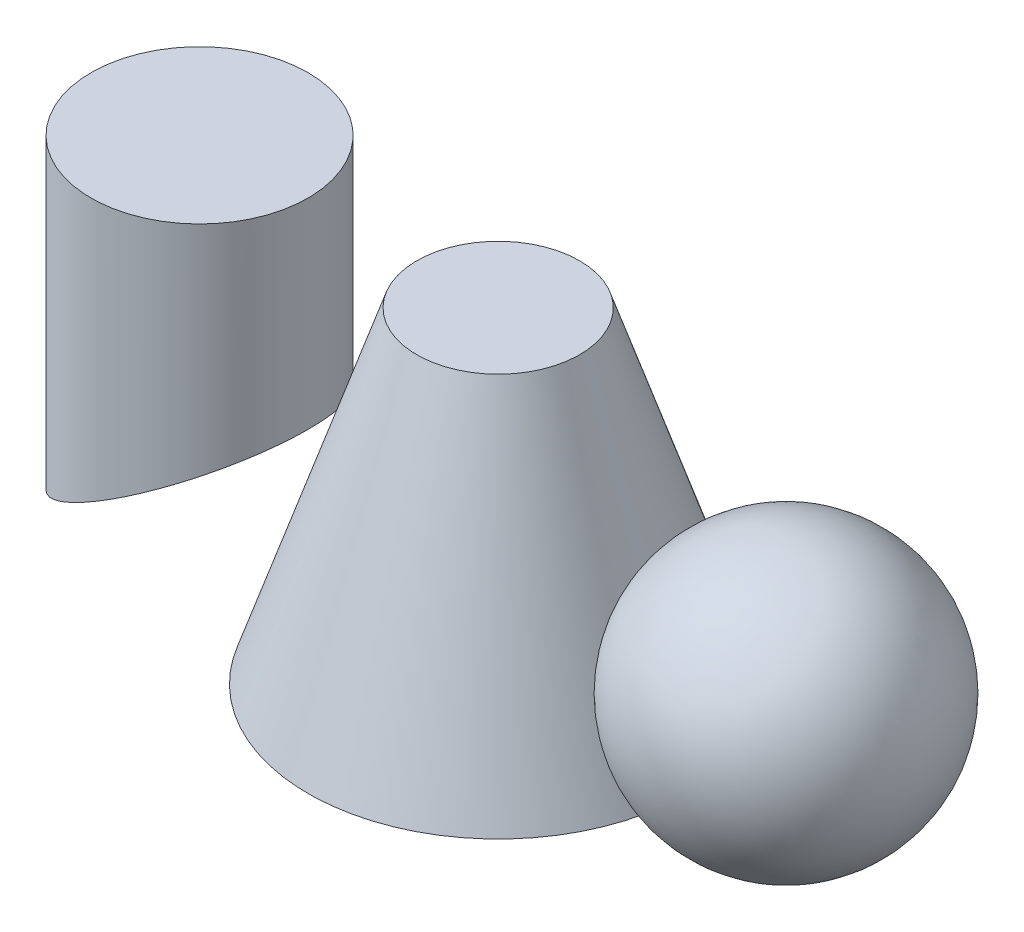
ISO-10303-21;
HEADER;
FILE_DESCRIPTION(('STEP AP214'),'2;1');
FILE_NAME('part.step','',(''),(''),'','','');
FILE_SCHEMA(('AUTOMOTIVE_DESIGN { 1 0 10303 214 1 1 1 1 }'));
ENDSEC;
DATA;
#1=APPLICATION_CONTEXT('core data for automotive mechanical design processes');
#2=APPLICATION_PROTOCOL_DEFINITION('international standard','automotive_design',2000,#1);
#3=PRODUCT_CONTEXT('',#1,'mechanical');
#4=PRODUCT('Part','Part','',(#3));
#5=PRODUCT_RELATED_PRODUCT_CATEGORY('part','',(#4));
#6=PRODUCT_DEFINITION_FORMATION('','',#4);
#7=PRODUCT_DEFINITION_CONTEXT('part definition',#1,'design');
#8=PRODUCT_DEFINITION('design','',#6,#7);
#9=PRODUCT_DEFINITION_SHAPE('','',#8);
#10=(LENGTH_UNIT() NAMED_UNIT(*) SI_UNIT(.MILLI.,.METRE.));
#11=(NAMED_UNIT(*) PLANE_ANGLE_UNIT() SI_UNIT($,.RADIAN.));
#12=(NAMED_UNIT(*) SI_UNIT($,.STERADIAN.) SOLID_ANGLE_UNIT());
#13=UNCERTAINTY_MEASURE_WITH_UNIT(LENGTH_MEASURE(1.E-05),#10,'distance_accuracy_value','');
#14=(GEOMETRIC_REPRESENTATION_CONTEXT(3) GLOBAL_UNCERTAINTY_ASSIGNED_CONTEXT((#13)) GLOBAL_UNIT_ASSIGNED_CONTEXT((#10,
#11,#12)) REPRESENTATION_CONTEXT('',''));
#15=CARTESIAN_POINT('',(0.,0.,0.));
#16=DIRECTION('',(0.,0.,1.));
#17=DIRECTION('',(1.,0.,0.));
#18=AXIS2_PLACEMENT_3D('',#15,#16,#17);
#19=CARTESIAN_POINT('',(53.0189805014032,25.,0.));
#20=DIRECTION('',(0.,1.,0.));
#21=DIRECTION('',(1.,0.,0.));
#22=AXIS2_PLACEMENT_3D('',#19,#20,#21);
#23=SPHERICAL_SURFACE('',#22,25.);
#24=CARTESIAN_POINT('',(53.0189805014032,50.,0.));
#25=VERTEX_POINT('',#24);
#26=VERTEX_LOOP('',#25);
#27=FACE_BOUND('',#26,.T.);
#28=ADVANCED_FACE('F36',(#27),#23,.T.);
#29=CLOSED_SHELL('',(#28));
#30=MANIFOLD_SOLID_BREP('B2',#29);
#31=CARTESIAN_POINT('',(-75.,0.,-30.));
#32=DIRECTION('',(-0.499999999999995,0.866025403784441,0.));
#33=DIRECTION('',(-0.866025403784442,-0.499999999999995,0.));
#34=AXIS2_PLACEMENT_3D('',#31,#32,#33);
#35=PLANE('',#34);
#36=CARTESIAN_POINT('',(-55.,11.5470053837924,0.));
#37=DIRECTION('',(-0.499999999999995,0.866025403784441,0.));
#38=DIRECTION('',(-0.866025403784442,-0.499999999999995,0.));
#39=AXIS2_PLACEMENT_3D('',#36,#37,#38);
#40=ELLIPSE('',#39,23.094010767585,20.);
#41=CARTESIAN_POINT('',(-75.,0.,0.));
#42=VERTEX_POINT('',#41);
#43=EDGE_CURVE('E65',#42,#42,#40,.F.);
#44=ORIENTED_EDGE('',*,*,#43,.T.);
#45=EDGE_LOOP('',(#44));
#46=FACE_BOUND('',#45,.T.);
#47=CARTESIAN_POINT('',(-55.,11.5470053837924,0.));
#48=DIRECTION('',(-0.499999999999995,0.866025403784441,0.));
#49=DIRECTION('',(-0.866025403784442,-0.499999999999995,0.));
#50=AXIS2_PLACEMENT_3D('',#47,#48,#49);
#51=ELLIPSE('',#50,21.9393102292057,19.);
#52=CARTESIAN_POINT('',(-74.,0.577350269189618,0.));
#53=VERTEX_POINT('',#52);
#54=EDGE_CURVE('E73',#53,#53,#51,.F.);
#55=ORIENTED_EDGE('',*,*,#54,.F.);
#56=EDGE_LOOP('',(#55));
#57=FACE_BOUND('',#56,.T.);
#58=ADVANCED_FACE('F58',(#46,#57),#35,.F.);
#59=CARTESIAN_POINT('',(-55.,0.,0.));
#60=DIRECTION('',(0.,-1.,0.));
#61=DIRECTION('',(0.,0.,-1.));
#62=AXIS2_PLACEMENT_3D('',#59,#60,#61);
#63=CYLINDRICAL_SURFACE('',#62,20.);
#64=ORIENTED_EDGE('',*,*,#43,.F.);
#65=EDGE_LOOP('',(#64));
#66=FACE_BOUND('',#65,.T.);
#67=CARTESIAN_POINT('',(-55.,60.,0.));
#68=DIRECTION('',(0.,-1.,0.));
#69=DIRECTION('',(0.,0.,-1.));
#70=AXIS2_PLACEMENT_3D('',#67,#68,#69);
#71=CIRCLE('',#70,20.);
#72=CARTESIAN_POINT('',(-55.,60.,-20.));
#73=VERTEX_POINT('',#72);
#74=EDGE_CURVE('E35',#73,#73,#71,.T.);
#75=ORIENTED_EDGE('',*,*,#74,.T.);
#76=EDGE_LOOP('',(#75));
#77=FACE_BOUND('',#76,.T.);
#78=ADVANCED_FACE('F60',(#66,#77),#63,.T.);
#79=CARTESIAN_POINT('',(-35.,60.,0.));
#80=DIRECTION('',(0.,1.,0.));
#81=DIRECTION('',(0.,0.,1.));
#82=AXIS2_PLACEMENT_3D('',#79,#80,#81);
#83=PLANE('',#82);
#84=ORIENTED_EDGE('',*,*,#74,.F.);
#85=EDGE_LOOP('',(#84));
#86=FACE_BOUND('',#85,.T.);
#87=ADVANCED_FACE('F87',(#86),#83,.T.);
#88=CARTESIAN_POINT('',(-55.,0.,0.));
#89=DIRECTION('',(0.,-1.,0.));
#90=DIRECTION('',(0.,0.,-1.));
#91=AXIS2_PLACEMENT_3D('',#88,#89,#90);
#92=CYLINDRICAL_SURFACE('',#91,19.);
#93=ORIENTED_EDGE('',*,*,#54,.T.);
#94=EDGE_LOOP('',(#93));
#95=FACE_BOUND('',#94,.T.);
#96=CARTESIAN_POINT('',(-55.,59.,0.));
#97=DIRECTION('',(0.,1.,0.));
#98=DIRECTION('',(0.,0.,1.));
#99=AXIS2_PLACEMENT_3D('',#96,#97,#98);
#100=CIRCLE('',#99,19.);
#101=CARTESIAN_POINT('',(-55.,59.,19.));
#102=VERTEX_POINT('',#101);
#103=EDGE_CURVE('E69',#102,#102,#100,.F.);
#104=ORIENTED_EDGE('',*,*,#103,.F.);
#105=EDGE_LOOP('',(#104));
#106=FACE_BOUND('',#105,.T.);
#107=ADVANCED_FACE('F79',(#95,#106),#92,.F.);
#108=CARTESIAN_POINT('',(-35.,59.,0.));
#109=DIRECTION('',(0.,1.,0.));
#110=DIRECTION('',(0.,0.,1.));
#111=AXIS2_PLACEMENT_3D('',#108,#109,#110);
#112=PLANE('',#111);
#113=ORIENTED_EDGE('',*,*,#103,.T.);
#114=EDGE_LOOP('',(#113));
#115=FACE_BOUND('',#114,.T.);
#116=ADVANCED_FACE('F90',(#115),#112,.F.);
#117=CLOSED_SHELL('',(#58,#78,#87,#107,#116));
#118=MANIFOLD_SOLID_BREP('B6',#117);
#119=CARTESIAN_POINT('',(35.,0.,0.));
#120=DIRECTION('',(0.,-1.,0.));
#121=DIRECTION('',(0.,0.,-1.));
#122=AXIS2_PLACEMENT_3D('',#119,#120,#121);
#123=PLANE('',#122);
#124=CARTESIAN_POINT('',(0.,0.,0.));
#125=DIRECTION('',(0.,-1.,0.));
#126=DIRECTION('',(0.,0.,-1.));
#127=AXIS2_PLACEMENT_3D('',#124,#125,#126);
#128=CIRCLE('',#127,33.9459074466105);
#129=CARTESIAN_POINT('',(0.,0.,-33.9459074466105));
#130=VERTEX_POINT('',#129);
#131=EDGE_CURVE('E142',#130,#130,#128,.T.);
#132=ORIENTED_EDGE('',*,*,#131,.F.);
#133=EDGE_LOOP('',(#132));
#134=FACE_BOUND('',#133,.T.);
#135=CARTESIAN_POINT('',(0.,0.,0.));
#136=DIRECTION('',(0.,-1.,0.));
#137=DIRECTION('',(0.,0.,-1.));
#138=AXIS2_PLACEMENT_3D('',#135,#136,#137);
#139=CIRCLE('',#138,35.);
#140=CARTESIAN_POINT('',(-35.,0.,0.));
#141=VERTEX_POINT('',#140);
#142=EDGE_CURVE('E135',#141,#141,#139,.T.);
#143=ORIENTED_EDGE('',*,*,#142,.T.);
#144=EDGE_LOOP('',(#143));
#145=FACE_BOUND('',#144,.T.);
#146=ADVANCED_FACE('F129',(#134,#145),#123,.T.);
#147=CARTESIAN_POINT('',(0.,60.,0.));
#148=DIRECTION('',(0.,1.,0.));
#149=DIRECTION('',(0.,0.,1.));
#150=AXIS2_PLACEMENT_3D('',#147,#148,#149);
#151=PLANE('',#150);
#152=CARTESIAN_POINT('',(0.,60.,0.));
#153=DIRECTION('',(0.,-1.,0.));
#154=DIRECTION('',(0.,0.,-1.));
#155=AXIS2_PLACEMENT_3D('',#152,#153,#154);
#156=CIRCLE('',#155,15.);
#157=CARTESIAN_POINT('',(0.,60.,-15.));
#158=VERTEX_POINT('',#157);
#159=EDGE_CURVE('E56',#158,#158,#156,.T.);
#160=ORIENTED_EDGE('',*,*,#159,.F.);
#161=EDGE_LOOP('',(#160));
#162=FACE_BOUND('',#161,.T.);
#163=ADVANCED_FACE('F151',(#162),#151,.T.);
#164=CARTESIAN_POINT('',(0.,0.,0.));
#165=DIRECTION('',(0.,-1.,0.));
#166=DIRECTION('',(0.,0.,-1.));
#167=AXIS2_PLACEMENT_3D('',#164,#165,#166);
#168=CONICAL_SURFACE('',#167,35.,0.321750554396642);
#169=ORIENTED_EDGE('',*,*,#159,.T.);
#170=EDGE_LOOP('',(#169));
#171=FACE_BOUND('',#170,.T.);
#172=ORIENTED_EDGE('',*,*,#142,.F.);
#173=EDGE_LOOP('',(#172));
#174=FACE_BOUND('',#173,.T.);
#175=ADVANCED_FACE('F155',(#171,#174),#168,.T.);
#176=CARTESIAN_POINT('',(0.,59.,0.));
#177=DIRECTION('',(0.,1.,0.));
#178=DIRECTION('',(0.,0.,1.));
#179=AXIS2_PLACEMENT_3D('',#176,#177,#178);
#180=PLANE('',#179);
#181=CARTESIAN_POINT('',(0.,59.,0.));
#182=DIRECTION('',(0.,1.,0.));
#183=DIRECTION('',(0.,0.,1.));
#184=AXIS2_PLACEMENT_3D('',#181,#182,#183);
#185=CIRCLE('',#184,14.2792407799439);
#186=CARTESIAN_POINT('',(0.,59.,14.2792407799439));
#187=VERTEX_POINT('',#186);
#188=EDGE_CURVE('E140',#187,#187,#185,.F.);
#189=ORIENTED_EDGE('',*,*,#188,.T.);
#190=EDGE_LOOP('',(#189));
#191=FACE_BOUND('',#190,.T.);
#192=ADVANCED_FACE('F160',(#191),#180,.F.);
#193=CARTESIAN_POINT('',(0.,-0.316227766016836,0.));
#194=DIRECTION('',(0.,-1.,0.));
#195=DIRECTION('',(0.,0.,-1.));
#196=AXIS2_PLACEMENT_3D('',#193,#194,#195);
#197=CONICAL_SURFACE('',#196,34.0513167019495,0.321750554396642);
#198=ORIENTED_EDGE('',*,*,#188,.F.);
#199=EDGE_LOOP('',(#198));
#200=FACE_BOUND('',#199,.T.);
#201=ORIENTED_EDGE('',*,*,#131,.T.);
#202=EDGE_LOOP('',(#201));
#203=FACE_BOUND('',#202,.T.);
#204=ADVANCED_FACE('F148',(#200,#203),#197,.F.);
#205=CLOSED_SHELL('',(#146,#163,#175,#192,#204));
#206=MANIFOLD_SOLID_BREP('B30',#205);
#207=ADVANCED_BREP_SHAPE_REPRESENTATION('',(#18,#30,#118,#206),#14);
#208=SHAPE_DEFINITION_REPRESENTATION(#9,#207);
ENDSEC;
END-ISO-10303-21;
